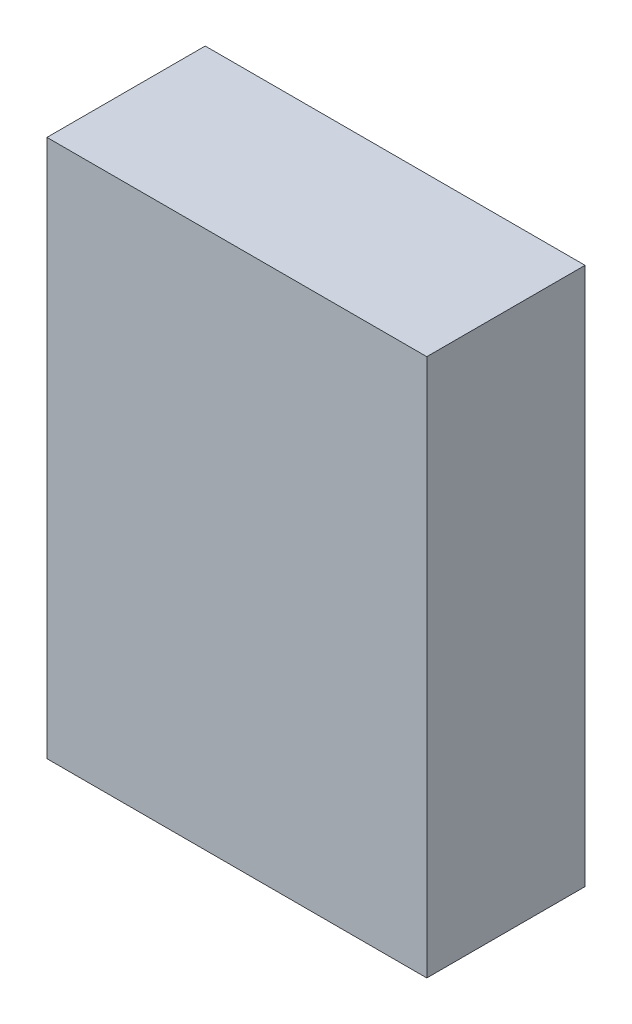
ISO-10303-21;
HEADER;
FILE_DESCRIPTION(('STEP AP214'),'2;1');
FILE_NAME('part.step','',(''),(''),'','','');
FILE_SCHEMA(('AUTOMOTIVE_DESIGN { 1 0 10303 214 1 1 1 1 }'));
ENDSEC;
DATA;
#1=APPLICATION_CONTEXT('core data for automotive mechanical design processes');
#2=APPLICATION_PROTOCOL_DEFINITION('international standard','automotive_design',2000,#1);
#3=PRODUCT_CONTEXT('',#1,'mechanical');
#4=PRODUCT('Part','Part','',(#3));
#5=PRODUCT_RELATED_PRODUCT_CATEGORY('part','',(#4));
#6=PRODUCT_DEFINITION_FORMATION('','',#4);
#7=PRODUCT_DEFINITION_CONTEXT('part definition',#1,'design');
#8=PRODUCT_DEFINITION('design','',#6,#7);
#9=PRODUCT_DEFINITION_SHAPE('','',#8);
#10=(LENGTH_UNIT() NAMED_UNIT(*) SI_UNIT(.MILLI.,.METRE.));
#11=(NAMED_UNIT(*) PLANE_ANGLE_UNIT() SI_UNIT($,.RADIAN.));
#12=(NAMED_UNIT(*) SI_UNIT($,.STERADIAN.) SOLID_ANGLE_UNIT());
#13=UNCERTAINTY_MEASURE_WITH_UNIT(LENGTH_MEASURE(1.E-05),#10,'distance_accuracy_value','');
#14=(GEOMETRIC_REPRESENTATION_CONTEXT(3) GLOBAL_UNCERTAINTY_ASSIGNED_CONTEXT((#13)) GLOBAL_UNIT_ASSIGNED_CONTEXT((#10,
#11,#12)) REPRESENTATION_CONTEXT('',''));
#15=CARTESIAN_POINT('',(0.,0.,0.));
#16=DIRECTION('',(0.,0.,1.));
#17=DIRECTION('',(1.,0.,0.));
#18=AXIS2_PLACEMENT_3D('',#15,#16,#17);
#19=CARTESIAN_POINT('',(-1.87,-2.92,0.));
#20=DIRECTION('',(1.,0.,0.));
#21=DIRECTION('',(0.,0.,1.));
#22=AXIS2_PLACEMENT_3D('',#19,#20,#21);
#23=PLANE('',#22);
#24=DIRECTION('',(0.,1.,0.));
#25=VECTOR('',#24,1.);
#26=CARTESIAN_POINT('',(-1.87,-2.92,0.1));
#27=LINE('',#26,#25);
#28=CARTESIAN_POINT('',(-1.87,-2.92,0.1));
#29=VERTEX_POINT('',#28);
#30=CARTESIAN_POINT('',(-1.87,-2.58,0.1));
#31=VERTEX_POINT('',#30);
#32=EDGE_CURVE('E11',#29,#31,#27,.T.);
#33=ORIENTED_EDGE('',*,*,#32,.T.);
#34=DIRECTION('',(0.,0.,1.));
#35=VECTOR('',#34,1.);
#36=CARTESIAN_POINT('',(-1.87,-2.58,0.));
#37=LINE('',#36,#35);
#38=CARTESIAN_POINT('',(-1.87,-2.58,0.));
#39=VERTEX_POINT('',#38);
#40=EDGE_CURVE('E24',#39,#31,#37,.T.);
#41=ORIENTED_EDGE('',*,*,#40,.F.);
#42=DIRECTION('',(0.,1.,0.));
#43=VECTOR('',#42,1.);
#44=CARTESIAN_POINT('',(-1.87,-2.92,0.));
#45=LINE('',#44,#43);
#46=CARTESIAN_POINT('',(-1.87,-2.92,0.));
#47=VERTEX_POINT('',#46);
#48=EDGE_CURVE('E86',#47,#39,#45,.T.);
#49=ORIENTED_EDGE('',*,*,#48,.F.);
#50=DIRECTION('',(0.,0.,1.));
#51=VECTOR('',#50,1.);
#52=CARTESIAN_POINT('',(-1.87,-2.92,0.));
#53=LINE('',#52,#51);
#54=EDGE_CURVE('E36',#47,#29,#53,.T.);
#55=ORIENTED_EDGE('',*,*,#54,.T.);
#56=EDGE_LOOP('',(#33,#41,#49,#55));
#57=FACE_BOUND('',#56,.T.);
#58=ADVANCED_FACE('F17',(#57),#23,.F.);
#59=CARTESIAN_POINT('',(-1.63,-2.92,0.));
#60=DIRECTION('',(1.,0.,0.));
#61=DIRECTION('',(0.,0.,1.));
#62=AXIS2_PLACEMENT_3D('',#59,#60,#61);
#63=PLANE('',#62);
#64=DIRECTION('',(0.,0.,1.));
#65=VECTOR('',#64,1.);
#66=CARTESIAN_POINT('',(-1.63,-2.92,0.));
#67=LINE('',#66,#65);
#68=CARTESIAN_POINT('',(-1.63,-2.92,0.));
#69=VERTEX_POINT('',#68);
#70=CARTESIAN_POINT('',(-1.63,-2.92,0.1));
#71=VERTEX_POINT('',#70);
#72=EDGE_CURVE('E83',#69,#71,#67,.T.);
#73=ORIENTED_EDGE('',*,*,#72,.F.);
#74=DIRECTION('',(0.,1.,0.));
#75=VECTOR('',#74,1.);
#76=CARTESIAN_POINT('',(-1.63,-2.92,0.));
#77=LINE('',#76,#75);
#78=CARTESIAN_POINT('',(-1.63,-2.58,0.));
#79=VERTEX_POINT('',#78);
#80=EDGE_CURVE('E63',#69,#79,#77,.T.);
#81=ORIENTED_EDGE('',*,*,#80,.T.);
#82=DIRECTION('',(0.,0.,1.));
#83=VECTOR('',#82,1.);
#84=CARTESIAN_POINT('',(-1.63,-2.58,0.));
#85=LINE('',#84,#83);
#86=CARTESIAN_POINT('',(-1.63,-2.58,0.1));
#87=VERTEX_POINT('',#86);
#88=EDGE_CURVE('E57',#79,#87,#85,.T.);
#89=ORIENTED_EDGE('',*,*,#88,.T.);
#90=DIRECTION('',(0.,1.,0.));
#91=VECTOR('',#90,1.);
#92=CARTESIAN_POINT('',(-1.63,-2.92,0.1));
#93=LINE('',#92,#91);
#94=EDGE_CURVE('E60',#71,#87,#93,.T.);
#95=ORIENTED_EDGE('',*,*,#94,.F.);
#96=EDGE_LOOP('',(#73,#81,#89,#95));
#97=FACE_BOUND('',#96,.T.);
#98=ADVANCED_FACE('F59',(#97),#63,.T.);
#99=CARTESIAN_POINT('',(-1.87,-2.92,0.));
#100=DIRECTION('',(0.,1.,0.));
#101=DIRECTION('',(0.,0.,1.));
#102=AXIS2_PLACEMENT_3D('',#99,#100,#101);
#103=PLANE('',#102);
#104=ORIENTED_EDGE('',*,*,#72,.T.);
#105=DIRECTION('',(1.,0.,0.));
#106=VECTOR('',#105,1.);
#107=CARTESIAN_POINT('',(-1.87,-2.92,0.1));
#108=LINE('',#107,#106);
#109=EDGE_CURVE('E71',#29,#71,#108,.T.);
#110=ORIENTED_EDGE('',*,*,#109,.F.);
#111=ORIENTED_EDGE('',*,*,#54,.F.);
#112=DIRECTION('',(1.,0.,0.));
#113=VECTOR('',#112,1.);
#114=CARTESIAN_POINT('',(-1.87,-2.92,0.));
#115=LINE('',#114,#113);
#116=EDGE_CURVE('E76',#47,#69,#115,.T.);
#117=ORIENTED_EDGE('',*,*,#116,.T.);
#118=EDGE_LOOP('',(#104,#110,#111,#117));
#119=FACE_BOUND('',#118,.T.);
#120=ADVANCED_FACE('F91',(#119),#103,.F.);
#121=CARTESIAN_POINT('',(-1.87,-2.58,0.));
#122=DIRECTION('',(0.,1.,0.));
#123=DIRECTION('',(0.,0.,1.));
#124=AXIS2_PLACEMENT_3D('',#121,#122,#123);
#125=PLANE('',#124);
#126=DIRECTION('',(1.,0.,0.));
#127=VECTOR('',#126,1.);
#128=CARTESIAN_POINT('',(-1.87,-2.58,0.));
#129=LINE('',#128,#127);
#130=EDGE_CURVE('E74',#39,#79,#129,.T.);
#131=ORIENTED_EDGE('',*,*,#130,.F.);
#132=ORIENTED_EDGE('',*,*,#40,.T.);
#133=DIRECTION('',(1.,0.,0.));
#134=VECTOR('',#133,1.);
#135=CARTESIAN_POINT('',(-1.87,-2.58,0.1));
#136=LINE('',#135,#134);
#137=EDGE_CURVE('E69',#31,#87,#136,.T.);
#138=ORIENTED_EDGE('',*,*,#137,.T.);
#139=ORIENTED_EDGE('',*,*,#88,.F.);
#140=EDGE_LOOP('',(#131,#132,#138,#139));
#141=FACE_BOUND('',#140,.T.);
#142=ADVANCED_FACE('F73',(#141),#125,.T.);
#143=CARTESIAN_POINT('',(-1.87,-2.92,0.));
#144=DIRECTION('',(0.,0.,1.));
#145=DIRECTION('',(1.,0.,0.));
#146=AXIS2_PLACEMENT_3D('',#143,#144,#145);
#147=PLANE('',#146);
#148=ORIENTED_EDGE('',*,*,#130,.T.);
#149=ORIENTED_EDGE('',*,*,#80,.F.);
#150=ORIENTED_EDGE('',*,*,#116,.F.);
#151=ORIENTED_EDGE('',*,*,#48,.T.);
#152=EDGE_LOOP('',(#148,#149,#150,#151));
#153=FACE_BOUND('',#152,.T.);
#154=ADVANCED_FACE('F89',(#153),#147,.F.);
#155=CARTESIAN_POINT('',(-1.87,-2.92,0.1));
#156=DIRECTION('',(0.,0.,1.));
#157=DIRECTION('',(1.,0.,0.));
#158=AXIS2_PLACEMENT_3D('',#155,#156,#157);
#159=PLANE('',#158);
#160=ORIENTED_EDGE('',*,*,#32,.F.);
#161=ORIENTED_EDGE('',*,*,#109,.T.);
#162=ORIENTED_EDGE('',*,*,#94,.T.);
#163=ORIENTED_EDGE('',*,*,#137,.F.);
#164=EDGE_LOOP('',(#160,#161,#162,#163));
#165=FACE_BOUND('',#164,.T.);
#166=ADVANCED_FACE('F68',(#165),#159,.T.);
#167=CLOSED_SHELL('',(#58,#98,#120,#142,#154,#166));
#168=MANIFOLD_SOLID_BREP('B1',#167);
#169=ADVANCED_BREP_SHAPE_REPRESENTATION('',(#18,#168),#14);
#170=SHAPE_DEFINITION_REPRESENTATION(#9,#169);
ENDSEC;
END-ISO-10303-21;
